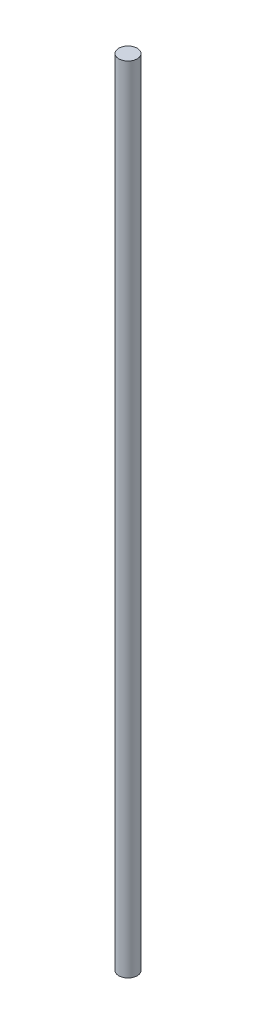
ISO-10303-21;
HEADER;
FILE_DESCRIPTION(('STEP AP214'),'2;1');
FILE_NAME('part.step','',(''),(''),'','','');
FILE_SCHEMA(('AUTOMOTIVE_DESIGN { 1 0 10303 214 1 1 1 1 }'));
ENDSEC;
DATA;
#1=APPLICATION_CONTEXT('core data for automotive mechanical design processes');
#2=APPLICATION_PROTOCOL_DEFINITION('international standard','automotive_design',2000,#1);
#3=PRODUCT_CONTEXT('',#1,'mechanical');
#4=PRODUCT('Part','Part','',(#3));
#5=PRODUCT_RELATED_PRODUCT_CATEGORY('part','',(#4));
#6=PRODUCT_DEFINITION_FORMATION('','',#4);
#7=PRODUCT_DEFINITION_CONTEXT('part definition',#1,'design');
#8=PRODUCT_DEFINITION('design','',#6,#7);
#9=PRODUCT_DEFINITION_SHAPE('','',#8);
#10=(LENGTH_UNIT() NAMED_UNIT(*) SI_UNIT(.MILLI.,.METRE.));
#11=(NAMED_UNIT(*) PLANE_ANGLE_UNIT() SI_UNIT($,.RADIAN.));
#12=(NAMED_UNIT(*) SI_UNIT($,.STERADIAN.) SOLID_ANGLE_UNIT());
#13=UNCERTAINTY_MEASURE_WITH_UNIT(LENGTH_MEASURE(1.E-05),#10,'distance_accuracy_value','');
#14=(GEOMETRIC_REPRESENTATION_CONTEXT(3) GLOBAL_UNCERTAINTY_ASSIGNED_CONTEXT((#13)) GLOBAL_UNIT_ASSIGNED_CONTEXT((#10,
#11,#12)) REPRESENTATION_CONTEXT('',''));
#15=CARTESIAN_POINT('',(0.,0.,0.));
#16=DIRECTION('',(0.,0.,1.));
#17=DIRECTION('',(1.,0.,0.));
#18=AXIS2_PLACEMENT_3D('',#15,#16,#17);
#19=CARTESIAN_POINT('',(0.,345.,0.));
#20=DIRECTION('',(0.,-1.,0.));
#21=DIRECTION('',(0.,0.,-1.));
#22=AXIS2_PLACEMENT_3D('',#19,#20,#21);
#23=CYLINDRICAL_SURFACE('',#22,4.);
#24=CARTESIAN_POINT('',(0.,345.,0.));
#25=DIRECTION('',(0.,1.,0.));
#26=DIRECTION('',(0.,0.,1.));
#27=AXIS2_PLACEMENT_3D('',#24,#25,#26);
#28=CIRCLE('',#27,4.);
#29=CARTESIAN_POINT('',(0.,345.,4.));
#30=VERTEX_POINT('',#29);
#31=EDGE_CURVE('E10',#30,#30,#28,.T.);
#32=ORIENTED_EDGE('',*,*,#31,.F.);
#33=EDGE_LOOP('',(#32));
#34=FACE_BOUND('',#33,.T.);
#35=CARTESIAN_POINT('',(0.,0.,0.));
#36=DIRECTION('',(0.,1.,0.));
#37=DIRECTION('',(0.,0.,1.));
#38=AXIS2_PLACEMENT_3D('',#35,#36,#37);
#39=CIRCLE('',#38,4.);
#40=CARTESIAN_POINT('',(0.,0.,4.));
#41=VERTEX_POINT('',#40);
#42=EDGE_CURVE('E31',#41,#41,#39,.T.);
#43=ORIENTED_EDGE('',*,*,#42,.T.);
#44=EDGE_LOOP('',(#43));
#45=FACE_BOUND('',#44,.T.);
#46=ADVANCED_FACE('F28',(#34,#45),#23,.T.);
#47=CARTESIAN_POINT('',(0.,345.,0.));
#48=DIRECTION('',(0.,1.,0.));
#49=DIRECTION('',(0.,0.,1.));
#50=AXIS2_PLACEMENT_3D('',#47,#48,#49);
#51=PLANE('',#50);
#52=ORIENTED_EDGE('',*,*,#31,.T.);
#53=EDGE_LOOP('',(#52));
#54=FACE_BOUND('',#53,.T.);
#55=ADVANCED_FACE('F43',(#54),#51,.T.);
#56=CARTESIAN_POINT('',(0.,0.,0.));
#57=DIRECTION('',(0.,1.,0.));
#58=DIRECTION('',(0.,0.,1.));
#59=AXIS2_PLACEMENT_3D('',#56,#57,#58);
#60=PLANE('',#59);
#61=ORIENTED_EDGE('',*,*,#42,.F.);
#62=EDGE_LOOP('',(#61));
#63=FACE_BOUND('',#62,.T.);
#64=ADVANCED_FACE('F41',(#63),#60,.F.);
#65=CLOSED_SHELL('',(#46,#55,#64));
#66=MANIFOLD_SOLID_BREP('B2',#65);
#67=ADVANCED_BREP_SHAPE_REPRESENTATION('',(#18,#66),#14);
#68=SHAPE_DEFINITION_REPRESENTATION(#9,#67);
ENDSEC;
END-ISO-10303-21;
